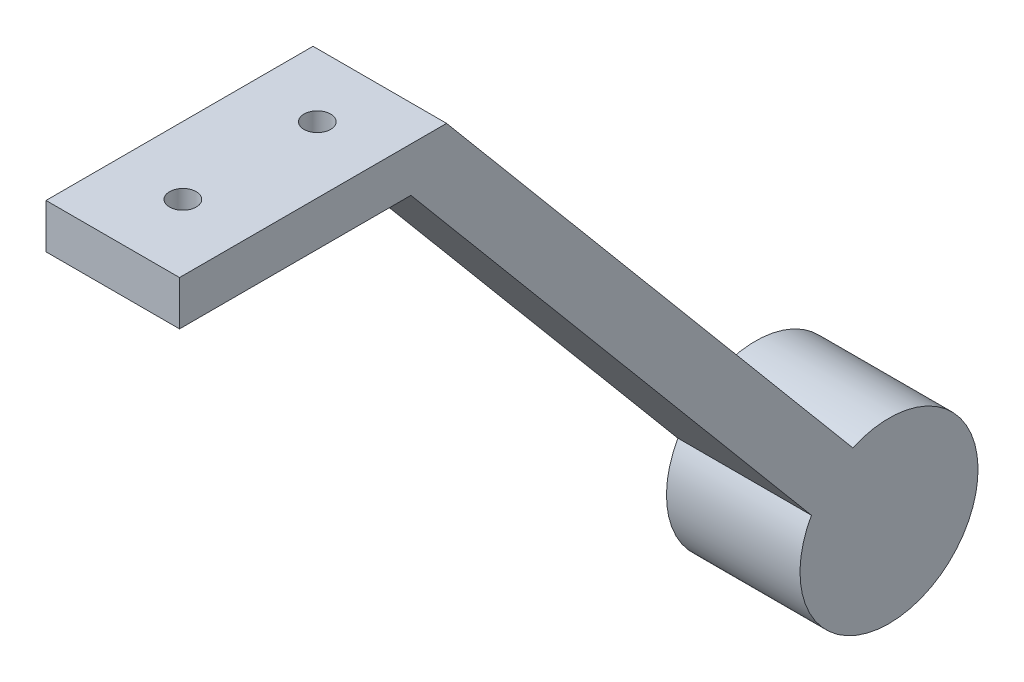
ISO-10303-21;
HEADER;
FILE_DESCRIPTION(('STEP AP214'),'2;1');
FILE_NAME('part.step','',(''),(''),'','','');
FILE_SCHEMA(('AUTOMOTIVE_DESIGN { 1 0 10303 214 1 1 1 1 }'));
ENDSEC;
DATA;
#1=APPLICATION_CONTEXT('core data for automotive mechanical design processes');
#2=APPLICATION_PROTOCOL_DEFINITION('international standard','automotive_design',2000,#1);
#3=PRODUCT_CONTEXT('',#1,'mechanical');
#4=PRODUCT('Part','Part','',(#3));
#5=PRODUCT_RELATED_PRODUCT_CATEGORY('part','',(#4));
#6=PRODUCT_DEFINITION_FORMATION('','',#4);
#7=PRODUCT_DEFINITION_CONTEXT('part definition',#1,'design');
#8=PRODUCT_DEFINITION('design','',#6,#7);
#9=PRODUCT_DEFINITION_SHAPE('','',#8);
#10=(LENGTH_UNIT() NAMED_UNIT(*) SI_UNIT(.MILLI.,.METRE.));
#11=(NAMED_UNIT(*) PLANE_ANGLE_UNIT() SI_UNIT($,.RADIAN.));
#12=(NAMED_UNIT(*) SI_UNIT($,.STERADIAN.) SOLID_ANGLE_UNIT());
#13=UNCERTAINTY_MEASURE_WITH_UNIT(LENGTH_MEASURE(1.E-05),#10,'distance_accuracy_value','');
#14=(GEOMETRIC_REPRESENTATION_CONTEXT(3) GLOBAL_UNCERTAINTY_ASSIGNED_CONTEXT((#13)) GLOBAL_UNIT_ASSIGNED_CONTEXT((#10,
#11,#12)) REPRESENTATION_CONTEXT('',''));
#15=CARTESIAN_POINT('',(0.,0.,0.));
#16=DIRECTION('',(0.,0.,1.));
#17=DIRECTION('',(1.,0.,0.));
#18=AXIS2_PLACEMENT_3D('',#15,#16,#17);
#19=CARTESIAN_POINT('',(-15.,0.,22.8989361702128));
#20=DIRECTION('',(0.,0.,1.));
#21=DIRECTION('',(1.,0.,0.));
#22=AXIS2_PLACEMENT_3D('',#19,#20,#21);
#23=PLANE('',#22);
#24=DIRECTION('',(0.,-1.,0.));
#25=VECTOR('',#24,1.);
#26=CARTESIAN_POINT('',(0.,0.,22.8989361702128));
#27=LINE('',#26,#25);
#28=CARTESIAN_POINT('',(0.,5.,22.8989361702128));
#29=VERTEX_POINT('',#28);
#30=CARTESIAN_POINT('',(0.,0.,22.8989361702128));
#31=VERTEX_POINT('',#30);
#32=EDGE_CURVE('E131',#29,#31,#27,.T.);
#33=ORIENTED_EDGE('',*,*,#32,.F.);
#34=DIRECTION('',(1.,0.,0.));
#35=VECTOR('',#34,1.);
#36=CARTESIAN_POINT('',(-15.,5.,22.8989361702128));
#37=LINE('',#36,#35);
#38=CARTESIAN_POINT('',(-15.,5.,22.8989361702128));
#39=VERTEX_POINT('',#38);
#40=EDGE_CURVE('E11',#39,#29,#37,.T.);
#41=ORIENTED_EDGE('',*,*,#40,.F.);
#42=DIRECTION('',(0.,-1.,0.));
#43=VECTOR('',#42,1.);
#44=CARTESIAN_POINT('',(-15.,0.,22.8989361702128));
#45=LINE('',#44,#43);
#46=CARTESIAN_POINT('',(-15.,0.,22.8989361702128));
#47=VERTEX_POINT('',#46);
#48=EDGE_CURVE('E151',#39,#47,#45,.T.);
#49=ORIENTED_EDGE('',*,*,#48,.T.);
#50=DIRECTION('',(1.,0.,0.));
#51=VECTOR('',#50,1.);
#52=CARTESIAN_POINT('',(-15.,0.,22.8989361702128));
#53=LINE('',#52,#51);
#54=EDGE_CURVE('E90',#47,#31,#53,.T.);
#55=ORIENTED_EDGE('',*,*,#54,.T.);
#56=EDGE_LOOP('',(#33,#41,#49,#55));
#57=FACE_BOUND('',#56,.T.);
#58=ADVANCED_FACE('F39',(#57),#23,.T.);
#59=CARTESIAN_POINT('',(-15.,5.,22.8989361702128));
#60=DIRECTION('',(0.,1.,0.));
#61=DIRECTION('',(0.,0.,1.));
#62=AXIS2_PLACEMENT_3D('',#59,#60,#61);
#63=PLANE('',#62);
#64=CARTESIAN_POINT('',(-7.41724612242795,5.,0.));
#65=DIRECTION('',(0.,1.,0.));
#66=DIRECTION('',(0.,0.,1.));
#67=AXIS2_PLACEMENT_3D('',#64,#65,#66);
#68=CIRCLE('',#67,1.5);
#69=CARTESIAN_POINT('',(-7.41724612242795,5.,1.5));
#70=VERTEX_POINT('',#69);
#71=EDGE_CURVE('E164',#70,#70,#68,.T.);
#72=ORIENTED_EDGE('',*,*,#71,.F.);
#73=EDGE_LOOP('',(#72));
#74=FACE_BOUND('',#73,.T.);
#75=CARTESIAN_POINT('',(-7.41724612242795,5.,15.1038468378794));
#76=DIRECTION('',(0.,1.,0.));
#77=DIRECTION('',(0.,0.,1.));
#78=AXIS2_PLACEMENT_3D('',#75,#76,#77);
#79=CIRCLE('',#78,1.5);
#80=CARTESIAN_POINT('',(-7.41724612242795,5.,16.6038468378794));
#81=VERTEX_POINT('',#80);
#82=EDGE_CURVE('E171',#81,#81,#79,.T.);
#83=ORIENTED_EDGE('',*,*,#82,.F.);
#84=EDGE_LOOP('',(#83));
#85=FACE_BOUND('',#84,.T.);
#86=DIRECTION('',(0.,0.,1.));
#87=VECTOR('',#86,1.);
#88=CARTESIAN_POINT('',(0.,5.,22.8989361702128));
#89=LINE('',#88,#87);
#90=CARTESIAN_POINT('',(0.,5.,-7.10106382978723));
#91=VERTEX_POINT('',#90);
#92=EDGE_CURVE('E148',#91,#29,#89,.T.);
#93=ORIENTED_EDGE('',*,*,#92,.F.);
#94=DIRECTION('',(1.,0.,0.));
#95=VECTOR('',#94,1.);
#96=CARTESIAN_POINT('',(-15.,5.,-7.10106382978723));
#97=LINE('',#96,#95);
#98=CARTESIAN_POINT('',(-15.,5.,-7.10106382978723));
#99=VERTEX_POINT('',#98);
#100=EDGE_CURVE('E49',#99,#91,#97,.T.);
#101=ORIENTED_EDGE('',*,*,#100,.F.);
#102=DIRECTION('',(0.,0.,1.));
#103=VECTOR('',#102,1.);
#104=CARTESIAN_POINT('',(-15.,5.,22.8989361702128));
#105=LINE('',#104,#103);
#106=EDGE_CURVE('E117',#99,#39,#105,.T.);
#107=ORIENTED_EDGE('',*,*,#106,.T.);
#108=ORIENTED_EDGE('',*,*,#40,.T.);
#109=EDGE_LOOP('',(#93,#101,#107,#108));
#110=FACE_BOUND('',#109,.T.);
#111=ADVANCED_FACE('F185',(#74,#85,#110),#63,.T.);
#112=CARTESIAN_POINT('',(-15.,5.,-7.10106382978723));
#113=DIRECTION('',(0.,0.642787609686543,-0.766044443118975));
#114=DIRECTION('',(0.,0.766044443118975,0.642787609686543));
#115=AXIS2_PLACEMENT_3D('',#112,#113,#114);
#116=PLANE('',#115);
#117=DIRECTION('',(0.,0.766044443118975,0.642787609686543));
#118=VECTOR('',#117,1.);
#119=CARTESIAN_POINT('',(0.,5.,-7.10106382978723));
#120=LINE('',#119,#118);
#121=CARTESIAN_POINT('',(0.,-49.3891554614472,-52.7389841175318));
#122=VERTEX_POINT('',#121);
#123=EDGE_CURVE('E103',#122,#91,#120,.T.);
#124=ORIENTED_EDGE('',*,*,#123,.F.);
#125=DIRECTION('',(1.,0.,0.));
#126=VECTOR('',#125,1.);
#127=CARTESIAN_POINT('',(-15.,-49.3891554614472,-52.7389841175318));
#128=LINE('',#127,#126);
#129=CARTESIAN_POINT('',(-15.,-49.3891554614472,-52.7389841175318));
#130=VERTEX_POINT('',#129);
#131=EDGE_CURVE('E98',#130,#122,#128,.T.);
#132=ORIENTED_EDGE('',*,*,#131,.F.);
#133=DIRECTION('',(0.,0.766044443118975,0.642787609686543));
#134=VECTOR('',#133,1.);
#135=CARTESIAN_POINT('',(-15.,5.,-7.10106382978723));
#136=LINE('',#135,#134);
#137=EDGE_CURVE('E101',#130,#99,#136,.T.);
#138=ORIENTED_EDGE('',*,*,#137,.T.);
#139=ORIENTED_EDGE('',*,*,#100,.T.);
#140=EDGE_LOOP('',(#124,#132,#138,#139));
#141=FACE_BOUND('',#140,.T.);
#142=ADVANCED_FACE('F100',(#141),#116,.T.);
#143=CARTESIAN_POINT('',(-15.,-58.524686563844,-56.8061786637935));
#144=DIRECTION('',(1.,0.,0.));
#145=DIRECTION('',(0.,0.,-1.));
#146=AXIS2_PLACEMENT_3D('',#143,#144,#145);
#147=CYLINDRICAL_SURFACE('',#146,9.99999999999999);
#148=CARTESIAN_POINT('',(0.,-58.524686563844,-56.8061786637935));
#149=DIRECTION('',(1.,0.,0.));
#150=DIRECTION('',(0.,0.,-1.));
#151=AXIS2_PLACEMENT_3D('',#148,#149,#150);
#152=CIRCLE('',#151,9.99999999999999);
#153=CARTESIAN_POINT('',(0.,-53.6231110183283,-48.0898401451492));
#154=VERTEX_POINT('',#153);
#155=EDGE_CURVE('E143',#154,#122,#152,.T.);
#156=ORIENTED_EDGE('',*,*,#155,.F.);
#157=DIRECTION('',(1.,0.,0.));
#158=VECTOR('',#157,1.);
#159=CARTESIAN_POINT('',(-15.,-53.6231110183283,-48.0898401451492));
#160=LINE('',#159,#158);
#161=CARTESIAN_POINT('',(-15.,-53.6231110183283,-48.0898401451492));
#162=VERTEX_POINT('',#161);
#163=EDGE_CURVE('E109',#162,#154,#160,.T.);
#164=ORIENTED_EDGE('',*,*,#163,.F.);
#165=CARTESIAN_POINT('',(-15.,-58.524686563844,-56.8061786637935));
#166=DIRECTION('',(1.,0.,0.));
#167=DIRECTION('',(0.,0.,-1.));
#168=AXIS2_PLACEMENT_3D('',#165,#166,#167);
#169=CIRCLE('',#168,9.99999999999999);
#170=EDGE_CURVE('E115',#162,#130,#169,.T.);
#171=ORIENTED_EDGE('',*,*,#170,.T.);
#172=ORIENTED_EDGE('',*,*,#131,.T.);
#173=EDGE_LOOP('',(#156,#164,#171,#172));
#174=FACE_BOUND('',#173,.T.);
#175=ADVANCED_FACE('F120',(#174),#147,.T.);
#176=CARTESIAN_POINT('',(-15.,0.,-3.09470746709122));
#177=DIRECTION('',(0.,-0.642787609686543,0.766044443118975));
#178=DIRECTION('',(0.,-0.766044443118975,-0.642787609686543));
#179=AXIS2_PLACEMENT_3D('',#176,#177,#178);
#180=PLANE('',#179);
#181=DIRECTION('',(0.,-0.766044443118975,-0.642787609686543));
#182=VECTOR('',#181,1.);
#183=CARTESIAN_POINT('',(0.,0.,-3.09470746709122));
#184=LINE('',#183,#182);
#185=CARTESIAN_POINT('',(0.,0.,-3.09470746709122));
#186=VERTEX_POINT('',#185);
#187=EDGE_CURVE('E139',#186,#154,#184,.T.);
#188=ORIENTED_EDGE('',*,*,#187,.F.);
#189=DIRECTION('',(1.,0.,0.));
#190=VECTOR('',#189,1.);
#191=CARTESIAN_POINT('',(-15.,0.,-3.09470746709122));
#192=LINE('',#191,#190);
#193=CARTESIAN_POINT('',(-15.,0.,-3.09470746709122));
#194=VERTEX_POINT('',#193);
#195=EDGE_CURVE('E157',#194,#186,#192,.T.);
#196=ORIENTED_EDGE('',*,*,#195,.F.);
#197=DIRECTION('',(0.,-0.766044443118975,-0.642787609686543));
#198=VECTOR('',#197,1.);
#199=CARTESIAN_POINT('',(-15.,0.,-3.09470746709122));
#200=LINE('',#199,#198);
#201=EDGE_CURVE('E122',#194,#162,#200,.T.);
#202=ORIENTED_EDGE('',*,*,#201,.T.);
#203=ORIENTED_EDGE('',*,*,#163,.T.);
#204=EDGE_LOOP('',(#188,#196,#202,#203));
#205=FACE_BOUND('',#204,.T.);
#206=ADVANCED_FACE('F200',(#205),#180,.T.);
#207=CARTESIAN_POINT('',(-15.,0.,-3.09470746709122));
#208=DIRECTION('',(0.,-1.,0.));
#209=DIRECTION('',(0.,0.,-1.));
#210=AXIS2_PLACEMENT_3D('',#207,#208,#209);
#211=PLANE('',#210);
#212=CARTESIAN_POINT('',(-7.41724612242795,0.,0.));
#213=DIRECTION('',(0.,-1.,0.));
#214=DIRECTION('',(0.,0.,-1.));
#215=AXIS2_PLACEMENT_3D('',#212,#213,#214);
#216=CIRCLE('',#215,1.5);
#217=CARTESIAN_POINT('',(-7.41724612242795,0.,-1.5));
#218=VERTEX_POINT('',#217);
#219=EDGE_CURVE('E42',#218,#218,#216,.T.);
#220=ORIENTED_EDGE('',*,*,#219,.F.);
#221=EDGE_LOOP('',(#220));
#222=FACE_BOUND('',#221,.T.);
#223=CARTESIAN_POINT('',(-7.41724612242795,0.,15.1038468378794));
#224=DIRECTION('',(0.,-1.,0.));
#225=DIRECTION('',(0.,0.,-1.));
#226=AXIS2_PLACEMENT_3D('',#223,#224,#225);
#227=CIRCLE('',#226,1.5);
#228=CARTESIAN_POINT('',(-7.41724612242795,0.,13.6038468378794));
#229=VERTEX_POINT('',#228);
#230=EDGE_CURVE('E161',#229,#229,#227,.T.);
#231=ORIENTED_EDGE('',*,*,#230,.F.);
#232=EDGE_LOOP('',(#231));
#233=FACE_BOUND('',#232,.T.);
#234=DIRECTION('',(0.,0.,-1.));
#235=VECTOR('',#234,1.);
#236=CARTESIAN_POINT('',(0.,0.,-3.09470746709122));
#237=LINE('',#236,#235);
#238=EDGE_CURVE('E135',#31,#186,#237,.T.);
#239=ORIENTED_EDGE('',*,*,#238,.F.);
#240=ORIENTED_EDGE('',*,*,#54,.F.);
#241=DIRECTION('',(0.,0.,-1.));
#242=VECTOR('',#241,1.);
#243=CARTESIAN_POINT('',(-15.,0.,-3.09470746709122));
#244=LINE('',#243,#242);
#245=EDGE_CURVE('E125',#47,#194,#244,.T.);
#246=ORIENTED_EDGE('',*,*,#245,.T.);
#247=ORIENTED_EDGE('',*,*,#195,.T.);
#248=EDGE_LOOP('',(#239,#240,#246,#247));
#249=FACE_BOUND('',#248,.T.);
#250=ADVANCED_FACE('F181',(#222,#233,#249),#211,.T.);
#251=CARTESIAN_POINT('',(-15.,-58.524686563844,-56.8061786637935));
#252=DIRECTION('',(1.,0.,0.));
#253=DIRECTION('',(0.,0.,-1.));
#254=AXIS2_PLACEMENT_3D('',#251,#252,#253);
#255=PLANE('',#254);
#256=ORIENTED_EDGE('',*,*,#48,.F.);
#257=ORIENTED_EDGE('',*,*,#106,.F.);
#258=ORIENTED_EDGE('',*,*,#137,.F.);
#259=ORIENTED_EDGE('',*,*,#170,.F.);
#260=ORIENTED_EDGE('',*,*,#201,.F.);
#261=ORIENTED_EDGE('',*,*,#245,.F.);
#262=EDGE_LOOP('',(#256,#257,#258,#259,#260,#261));
#263=FACE_BOUND('',#262,.T.);
#264=ADVANCED_FACE('F113',(#263),#255,.F.);
#265=CARTESIAN_POINT('',(0.,-58.524686563844,-56.8061786637935));
#266=DIRECTION('',(1.,0.,0.));
#267=DIRECTION('',(0.,0.,-1.));
#268=AXIS2_PLACEMENT_3D('',#265,#266,#267);
#269=PLANE('',#268);
#270=ORIENTED_EDGE('',*,*,#32,.T.);
#271=ORIENTED_EDGE('',*,*,#238,.T.);
#272=ORIENTED_EDGE('',*,*,#187,.T.);
#273=ORIENTED_EDGE('',*,*,#155,.T.);
#274=ORIENTED_EDGE('',*,*,#123,.T.);
#275=ORIENTED_EDGE('',*,*,#92,.T.);
#276=EDGE_LOOP('',(#270,#271,#272,#273,#274,#275));
#277=FACE_BOUND('',#276,.T.);
#278=ADVANCED_FACE('F184',(#277),#269,.T.);
#279=CARTESIAN_POINT('',(-7.41724612242795,-10.,15.1038468378794));
#280=DIRECTION('',(0.,1.,0.));
#281=DIRECTION('',(0.,0.,1.));
#282=AXIS2_PLACEMENT_3D('',#279,#280,#281);
#283=CYLINDRICAL_SURFACE('',#282,1.5);
#284=ORIENTED_EDGE('',*,*,#230,.T.);
#285=EDGE_LOOP('',(#284));
#286=FACE_BOUND('',#285,.T.);
#287=ORIENTED_EDGE('',*,*,#82,.T.);
#288=EDGE_LOOP('',(#287));
#289=FACE_BOUND('',#288,.T.);
#290=ADVANCED_FACE('F213',(#286,#289),#283,.F.);
#291=CARTESIAN_POINT('',(-7.41724612242795,-10.,0.));
#292=DIRECTION('',(0.,1.,0.));
#293=DIRECTION('',(0.,0.,1.));
#294=AXIS2_PLACEMENT_3D('',#291,#292,#293);
#295=CYLINDRICAL_SURFACE('',#294,1.5);
#296=ORIENTED_EDGE('',*,*,#219,.T.);
#297=EDGE_LOOP('',(#296));
#298=FACE_BOUND('',#297,.T.);
#299=ORIENTED_EDGE('',*,*,#71,.T.);
#300=EDGE_LOOP('',(#299));
#301=FACE_BOUND('',#300,.T.);
#302=ADVANCED_FACE('F211',(#298,#301),#295,.F.);
#303=CLOSED_SHELL('',(#58,#111,#142,#175,#206,#250,#264,#278,#290,#302));
#304=MANIFOLD_SOLID_BREP('B2',#303);
#305=ADVANCED_BREP_SHAPE_REPRESENTATION('',(#18,#304),#14);
#306=SHAPE_DEFINITION_REPRESENTATION(#9,#305);
ENDSEC;
END-ISO-10303-21;
